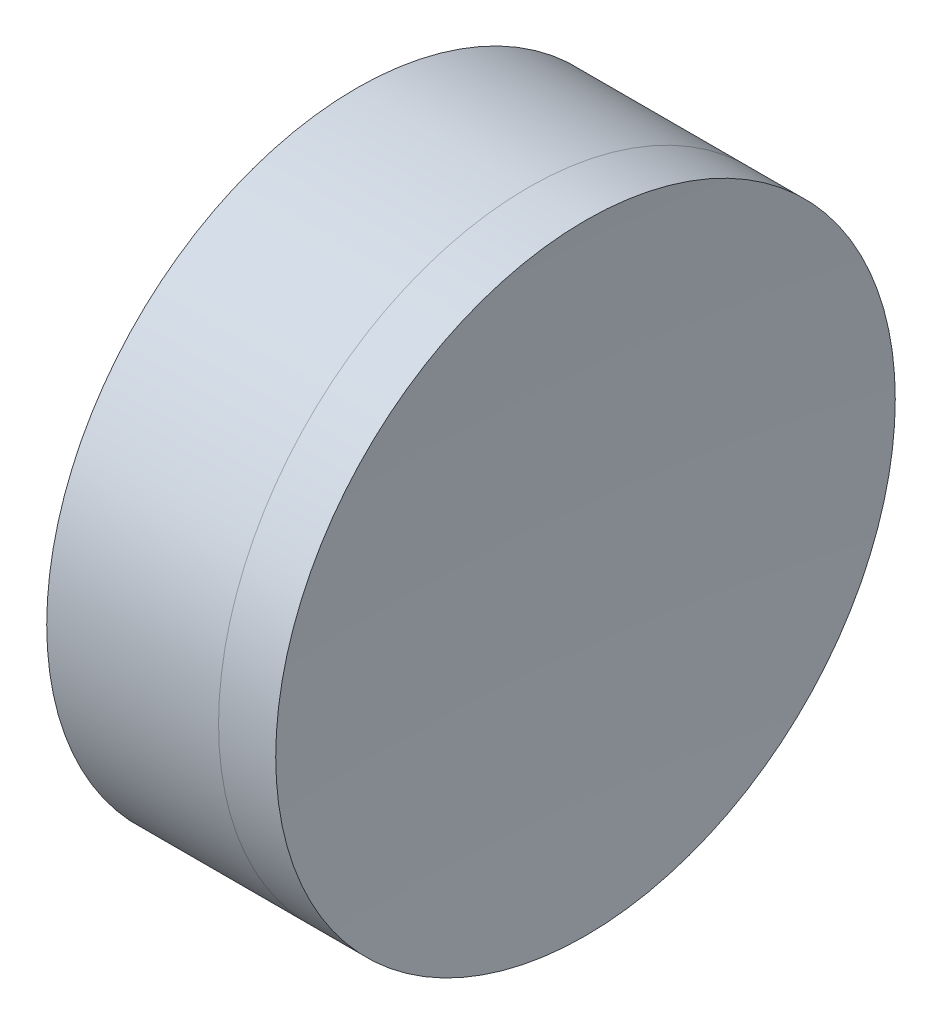
ISO-10303-21;
HEADER;
FILE_DESCRIPTION(('STEP AP214'),'2;1');
FILE_NAME('part.step','',(''),(''),'','','');
FILE_SCHEMA(('AUTOMOTIVE_DESIGN { 1 0 10303 214 1 1 1 1 }'));
ENDSEC;
DATA;
#1=APPLICATION_CONTEXT('core data for automotive mechanical design processes');
#2=APPLICATION_PROTOCOL_DEFINITION('international standard','automotive_design',2000,#1);
#3=PRODUCT_CONTEXT('',#1,'mechanical');
#4=PRODUCT('Part','Part','',(#3));
#5=PRODUCT_RELATED_PRODUCT_CATEGORY('part','',(#4));
#6=PRODUCT_DEFINITION_FORMATION('','',#4);
#7=PRODUCT_DEFINITION_CONTEXT('part definition',#1,'design');
#8=PRODUCT_DEFINITION('design','',#6,#7);
#9=PRODUCT_DEFINITION_SHAPE('','',#8);
#10=(LENGTH_UNIT() NAMED_UNIT(*) SI_UNIT(.MILLI.,.METRE.));
#11=(NAMED_UNIT(*) PLANE_ANGLE_UNIT() SI_UNIT($,.RADIAN.));
#12=(NAMED_UNIT(*) SI_UNIT($,.STERADIAN.) SOLID_ANGLE_UNIT());
#13=UNCERTAINTY_MEASURE_WITH_UNIT(LENGTH_MEASURE(1.E-05),#10,'distance_accuracy_value','');
#14=(GEOMETRIC_REPRESENTATION_CONTEXT(3) GLOBAL_UNCERTAINTY_ASSIGNED_CONTEXT((#13)) GLOBAL_UNIT_ASSIGNED_CONTEXT((#10,
#11,#12)) REPRESENTATION_CONTEXT('',''));
#15=CARTESIAN_POINT('',(0.,0.,0.));
#16=DIRECTION('',(0.,0.,1.));
#17=DIRECTION('',(1.,0.,0.));
#18=AXIS2_PLACEMENT_3D('',#15,#16,#17);
#19=CARTESIAN_POINT('',(293.367363260473,0.,0.));
#20=DIRECTION('',(-1.,0.,0.));
#21=DIRECTION('',(0.,0.,1.));
#22=AXIS2_PLACEMENT_3D('',#19,#20,#21);
#23=SPHERICAL_SURFACE('',#22,32.5);
#24=CARTESIAN_POINT('',(263.45148119091,0.,0.));
#25=DIRECTION('',(-1.,0.,0.));
#26=DIRECTION('',(0.,0.,1.));
#27=AXIS2_PLACEMENT_3D('',#24,#25,#26);
#28=CIRCLE('',#27,12.7);
#29=CARTESIAN_POINT('',(263.45148119091,0.,12.7));
#30=VERTEX_POINT('',#29);
#31=EDGE_CURVE('E11',#30,#30,#28,.T.);
#32=ORIENTED_EDGE('',*,*,#31,.T.);
#33=EDGE_LOOP('',(#32));
#34=FACE_BOUND('',#33,.T.);
#35=ADVANCED_FACE('F45',(#34),#23,.T.);
#36=CARTESIAN_POINT('',(256.406386707625,0.,0.));
#37=DIRECTION('',(-1.,0.,0.));
#38=DIRECTION('',(0.,0.,1.));
#39=AXIS2_PLACEMENT_3D('',#36,#37,#38);
#40=CYLINDRICAL_SURFACE('',#39,12.7);
#41=CARTESIAN_POINT('',(265.794086550024,0.,0.));
#42=DIRECTION('',(-1.,0.,0.));
#43=DIRECTION('',(0.,0.,1.));
#44=AXIS2_PLACEMENT_3D('',#41,#42,#43);
#45=CIRCLE('',#44,12.7);
#46=CARTESIAN_POINT('',(265.794086550024,0.,12.7));
#47=VERTEX_POINT('',#46);
#48=EDGE_CURVE('E51',#47,#47,#45,.T.);
#49=ORIENTED_EDGE('',*,*,#48,.T.);
#50=EDGE_LOOP('',(#49));
#51=FACE_BOUND('',#50,.T.);
#52=ORIENTED_EDGE('',*,*,#31,.F.);
#53=EDGE_LOOP('',(#52));
#54=FACE_BOUND('',#53,.T.);
#55=ADVANCED_FACE('F57',(#51,#54),#40,.T.);
#56=CARTESIAN_POINT('',(454.567363260473,0.,0.));
#57=DIRECTION('',(-1.,0.,0.));
#58=DIRECTION('',(0.,0.,-1.));
#59=AXIS2_PLACEMENT_3D('',#56,#57,#58);
#60=SPHERICAL_SURFACE('',#59,189.2);
#61=ORIENTED_EDGE('',*,*,#48,.F.);
#62=EDGE_LOOP('',(#61));
#63=FACE_BOUND('',#62,.T.);
#64=ADVANCED_FACE('F60',(#63),#60,.F.);
#65=CLOSED_SHELL('',(#35,#55,#64));
#66=MANIFOLD_SOLID_BREP('B2',#65);
#67=CARTESIAN_POINT('',(224.867363260473,0.,0.));
#68=DIRECTION('',(-1.,0.,0.));
#69=DIRECTION('',(0.,0.,1.));
#70=AXIS2_PLACEMENT_3D('',#67,#68,#69);
#71=SPHERICAL_SURFACE('',#70,34.);
#72=CARTESIAN_POINT('',(256.406386707625,0.,0.));
#73=DIRECTION('',(-1.,0.,0.));
#74=DIRECTION('',(0.,0.,1.));
#75=AXIS2_PLACEMENT_3D('',#72,#73,#74);
#76=CIRCLE('',#75,12.7);
#77=CARTESIAN_POINT('',(256.406386707625,0.,12.7));
#78=VERTEX_POINT('',#77);
#79=EDGE_CURVE('E44',#78,#78,#76,.T.);
#80=ORIENTED_EDGE('',*,*,#79,.T.);
#81=EDGE_LOOP('',(#80));
#82=FACE_BOUND('',#81,.T.);
#83=ADVANCED_FACE('F86',(#82),#71,.F.);
#84=CARTESIAN_POINT('',(-0.816062176165804,0.,0.));
#85=DIRECTION('',(-1.,0.,0.));
#86=DIRECTION('',(0.,0.,1.));
#87=AXIS2_PLACEMENT_3D('',#84,#85,#86);
#88=CYLINDRICAL_SURFACE('',#87,12.7);
#89=CARTESIAN_POINT('',(263.45148119091,0.,0.));
#90=DIRECTION('',(-1.,0.,0.));
#91=DIRECTION('',(0.,0.,1.));
#92=AXIS2_PLACEMENT_3D('',#89,#90,#91);
#93=CIRCLE('',#92,12.7);
#94=CARTESIAN_POINT('',(263.45148119091,0.,12.7));
#95=VERTEX_POINT('',#94);
#96=EDGE_CURVE('E92',#95,#95,#93,.T.);
#97=ORIENTED_EDGE('',*,*,#96,.T.);
#98=EDGE_LOOP('',(#97));
#99=FACE_BOUND('',#98,.T.);
#100=ORIENTED_EDGE('',*,*,#79,.F.);
#101=EDGE_LOOP('',(#100));
#102=FACE_BOUND('',#101,.T.);
#103=ADVANCED_FACE('F98',(#99,#102),#88,.T.);
#104=CARTESIAN_POINT('',(293.367363260473,0.,0.));
#105=DIRECTION('',(-1.,0.,0.));
#106=DIRECTION('',(0.,0.,-1.));
#107=AXIS2_PLACEMENT_3D('',#104,#105,#106);
#108=SPHERICAL_SURFACE('',#107,32.5);
#109=ORIENTED_EDGE('',*,*,#96,.F.);
#110=EDGE_LOOP('',(#109));
#111=FACE_BOUND('',#110,.T.);
#112=ADVANCED_FACE('F101',(#111),#108,.F.);
#113=CLOSED_SHELL('',(#83,#103,#112));
#114=MANIFOLD_SOLID_BREP('B6',#113);
#115=ADVANCED_BREP_SHAPE_REPRESENTATION('',(#18,#66,#114),#14);
#116=SHAPE_DEFINITION_REPRESENTATION(#9,#115);
ENDSEC;
END-ISO-10303-21;
